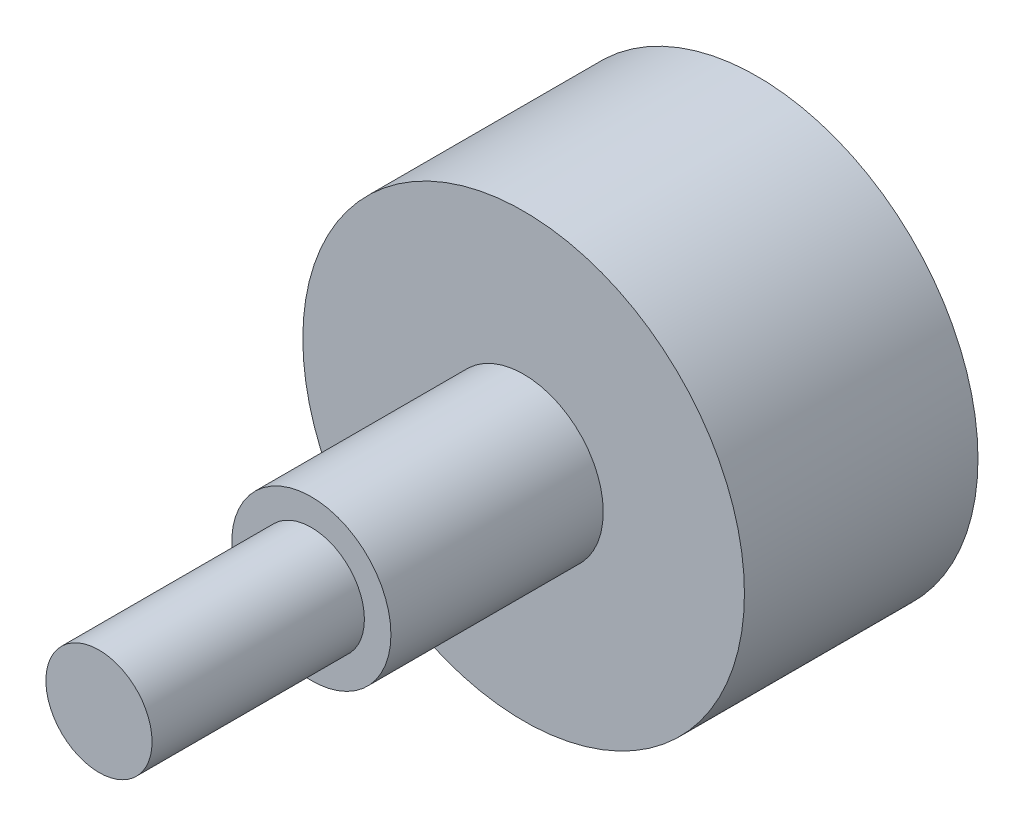
ISO-10303-21;
HEADER;
FILE_DESCRIPTION(('STEP AP214'),'2;1');
FILE_NAME('part.step','',(''),(''),'','','');
FILE_SCHEMA(('AUTOMOTIVE_DESIGN { 1 0 10303 214 1 1 1 1 }'));
ENDSEC;
DATA;
#1=APPLICATION_CONTEXT('core data for automotive mechanical design processes');
#2=APPLICATION_PROTOCOL_DEFINITION('international standard','automotive_design',2000,#1);
#3=PRODUCT_CONTEXT('',#1,'mechanical');
#4=PRODUCT('Part','Part','',(#3));
#5=PRODUCT_RELATED_PRODUCT_CATEGORY('part','',(#4));
#6=PRODUCT_DEFINITION_FORMATION('','',#4);
#7=PRODUCT_DEFINITION_CONTEXT('part definition',#1,'design');
#8=PRODUCT_DEFINITION('design','',#6,#7);
#9=PRODUCT_DEFINITION_SHAPE('','',#8);
#10=(LENGTH_UNIT() NAMED_UNIT(*) SI_UNIT(.MILLI.,.METRE.));
#11=(NAMED_UNIT(*) PLANE_ANGLE_UNIT() SI_UNIT($,.RADIAN.));
#12=(NAMED_UNIT(*) SI_UNIT($,.STERADIAN.) SOLID_ANGLE_UNIT());
#13=UNCERTAINTY_MEASURE_WITH_UNIT(LENGTH_MEASURE(1.E-05),#10,'distance_accuracy_value','');
#14=(GEOMETRIC_REPRESENTATION_CONTEXT(3) GLOBAL_UNCERTAINTY_ASSIGNED_CONTEXT((#13)) GLOBAL_UNIT_ASSIGNED_CONTEXT((#10,
#11,#12)) REPRESENTATION_CONTEXT('',''));
#15=CARTESIAN_POINT('',(0.,0.,0.));
#16=DIRECTION('',(0.,0.,1.));
#17=DIRECTION('',(1.,0.,0.));
#18=AXIS2_PLACEMENT_3D('',#15,#16,#17);
#19=CARTESIAN_POINT('',(0.,0.,26.67));
#20=DIRECTION('',(0.,0.,1.));
#21=DIRECTION('',(1.,0.,0.));
#22=AXIS2_PLACEMENT_3D('',#19,#20,#21);
#23=PLANE('',#22);
#24=CARTESIAN_POINT('',(0.,0.,26.67));
#25=DIRECTION('',(0.,0.,1.));
#26=DIRECTION('',(1.,0.,0.));
#27=AXIS2_PLACEMENT_3D('',#24,#25,#26);
#28=CIRCLE('',#27,4.7625);
#29=CARTESIAN_POINT('',(4.7625,0.,26.67));
#30=VERTEX_POINT('',#29);
#31=EDGE_CURVE('E40',#30,#30,#28,.T.);
#32=ORIENTED_EDGE('',*,*,#31,.T.);
#33=EDGE_LOOP('',(#32));
#34=FACE_BOUND('',#33,.T.);
#35=CARTESIAN_POINT('',(0.,0.,26.67));
#36=DIRECTION('',(0.,0.,1.));
#37=DIRECTION('',(1.,0.,0.));
#38=AXIS2_PLACEMENT_3D('',#35,#36,#37);
#39=CIRCLE('',#38,3.175);
#40=CARTESIAN_POINT('',(3.175,0.,26.67));
#41=VERTEX_POINT('',#40);
#42=EDGE_CURVE('E48',#41,#41,#39,.T.);
#43=ORIENTED_EDGE('',*,*,#42,.F.);
#44=EDGE_LOOP('',(#43));
#45=FACE_BOUND('',#44,.T.);
#46=ADVANCED_FACE('F29',(#34,#45),#23,.T.);
#47=CARTESIAN_POINT('',(0.,0.,13.97));
#48=DIRECTION('',(0.,0.,1.));
#49=DIRECTION('',(1.,0.,0.));
#50=AXIS2_PLACEMENT_3D('',#47,#48,#49);
#51=PLANE('',#50);
#52=CARTESIAN_POINT('',(0.,0.,13.97));
#53=DIRECTION('',(0.,0.,1.));
#54=DIRECTION('',(1.,0.,0.));
#55=AXIS2_PLACEMENT_3D('',#52,#53,#54);
#56=CIRCLE('',#55,13.208);
#57=CARTESIAN_POINT('',(13.208,0.,13.97));
#58=VERTEX_POINT('',#57);
#59=EDGE_CURVE('E10',#58,#58,#56,.T.);
#60=ORIENTED_EDGE('',*,*,#59,.T.);
#61=EDGE_LOOP('',(#60));
#62=FACE_BOUND('',#61,.T.);
#63=CARTESIAN_POINT('',(0.,0.,13.97));
#64=DIRECTION('',(0.,0.,1.));
#65=DIRECTION('',(1.,0.,0.));
#66=AXIS2_PLACEMENT_3D('',#63,#64,#65);
#67=CIRCLE('',#66,4.7625);
#68=CARTESIAN_POINT('',(4.7625,0.,13.97));
#69=VERTEX_POINT('',#68);
#70=EDGE_CURVE('E42',#69,#69,#67,.T.);
#71=ORIENTED_EDGE('',*,*,#70,.F.);
#72=EDGE_LOOP('',(#71));
#73=FACE_BOUND('',#72,.T.);
#74=ADVANCED_FACE('F64',(#62,#73),#51,.T.);
#75=CARTESIAN_POINT('',(0.,0.,13.97));
#76=DIRECTION('',(0.,0.,-1.));
#77=DIRECTION('',(-1.,0.,0.));
#78=AXIS2_PLACEMENT_3D('',#75,#76,#77);
#79=CYLINDRICAL_SURFACE('',#78,13.208);
#80=ORIENTED_EDGE('',*,*,#59,.F.);
#81=EDGE_LOOP('',(#80));
#82=FACE_BOUND('',#81,.T.);
#83=CARTESIAN_POINT('',(0.,0.,0.));
#84=DIRECTION('',(0.,0.,1.));
#85=DIRECTION('',(1.,0.,0.));
#86=AXIS2_PLACEMENT_3D('',#83,#84,#85);
#87=CIRCLE('',#86,13.208);
#88=CARTESIAN_POINT('',(13.208,0.,0.));
#89=VERTEX_POINT('',#88);
#90=EDGE_CURVE('E33',#89,#89,#87,.T.);
#91=ORIENTED_EDGE('',*,*,#90,.T.);
#92=EDGE_LOOP('',(#91));
#93=FACE_BOUND('',#92,.T.);
#94=ADVANCED_FACE('F31',(#82,#93),#79,.T.);
#95=CARTESIAN_POINT('',(0.,0.,0.));
#96=DIRECTION('',(0.,0.,1.));
#97=DIRECTION('',(1.,0.,0.));
#98=AXIS2_PLACEMENT_3D('',#95,#96,#97);
#99=PLANE('',#98);
#100=ORIENTED_EDGE('',*,*,#90,.F.);
#101=EDGE_LOOP('',(#100));
#102=FACE_BOUND('',#101,.T.);
#103=ADVANCED_FACE('F74',(#102),#99,.F.);
#104=CARTESIAN_POINT('',(0.,0.,26.67));
#105=DIRECTION('',(0.,0.,-1.));
#106=DIRECTION('',(-1.,0.,0.));
#107=AXIS2_PLACEMENT_3D('',#104,#105,#106);
#108=CYLINDRICAL_SURFACE('',#107,4.7625);
#109=ORIENTED_EDGE('',*,*,#31,.F.);
#110=EDGE_LOOP('',(#109));
#111=FACE_BOUND('',#110,.T.);
#112=ORIENTED_EDGE('',*,*,#70,.T.);
#113=EDGE_LOOP('',(#112));
#114=FACE_BOUND('',#113,.T.);
#115=ADVANCED_FACE('F59',(#111,#114),#108,.T.);
#116=CARTESIAN_POINT('',(0.,0.,39.37));
#117=DIRECTION('',(0.,0.,-1.));
#118=DIRECTION('',(-1.,0.,0.));
#119=AXIS2_PLACEMENT_3D('',#116,#117,#118);
#120=CYLINDRICAL_SURFACE('',#119,3.175);
#121=CARTESIAN_POINT('',(0.,0.,39.37));
#122=DIRECTION('',(0.,0.,1.));
#123=DIRECTION('',(1.,0.,0.));
#124=AXIS2_PLACEMENT_3D('',#121,#122,#123);
#125=CIRCLE('',#124,3.175);
#126=CARTESIAN_POINT('',(3.175,0.,39.37));
#127=VERTEX_POINT('',#126);
#128=EDGE_CURVE('E45',#127,#127,#125,.T.);
#129=ORIENTED_EDGE('',*,*,#128,.F.);
#130=EDGE_LOOP('',(#129));
#131=FACE_BOUND('',#130,.T.);
#132=ORIENTED_EDGE('',*,*,#42,.T.);
#133=EDGE_LOOP('',(#132));
#134=FACE_BOUND('',#133,.T.);
#135=ADVANCED_FACE('F56',(#131,#134),#120,.T.);
#136=CARTESIAN_POINT('',(0.,0.,39.37));
#137=DIRECTION('',(0.,0.,1.));
#138=DIRECTION('',(1.,0.,0.));
#139=AXIS2_PLACEMENT_3D('',#136,#137,#138);
#140=PLANE('',#139);
#141=ORIENTED_EDGE('',*,*,#128,.T.);
#142=EDGE_LOOP('',(#141));
#143=FACE_BOUND('',#142,.T.);
#144=ADVANCED_FACE('F54',(#143),#140,.T.);
#145=CLOSED_SHELL('',(#46,#74,#94,#103,#115,#135,#144));
#146=MANIFOLD_SOLID_BREP('B2',#145);
#147=ADVANCED_BREP_SHAPE_REPRESENTATION('',(#18,#146),#14);
#148=SHAPE_DEFINITION_REPRESENTATION(#9,#147);
ENDSEC;
END-ISO-10303-21;
